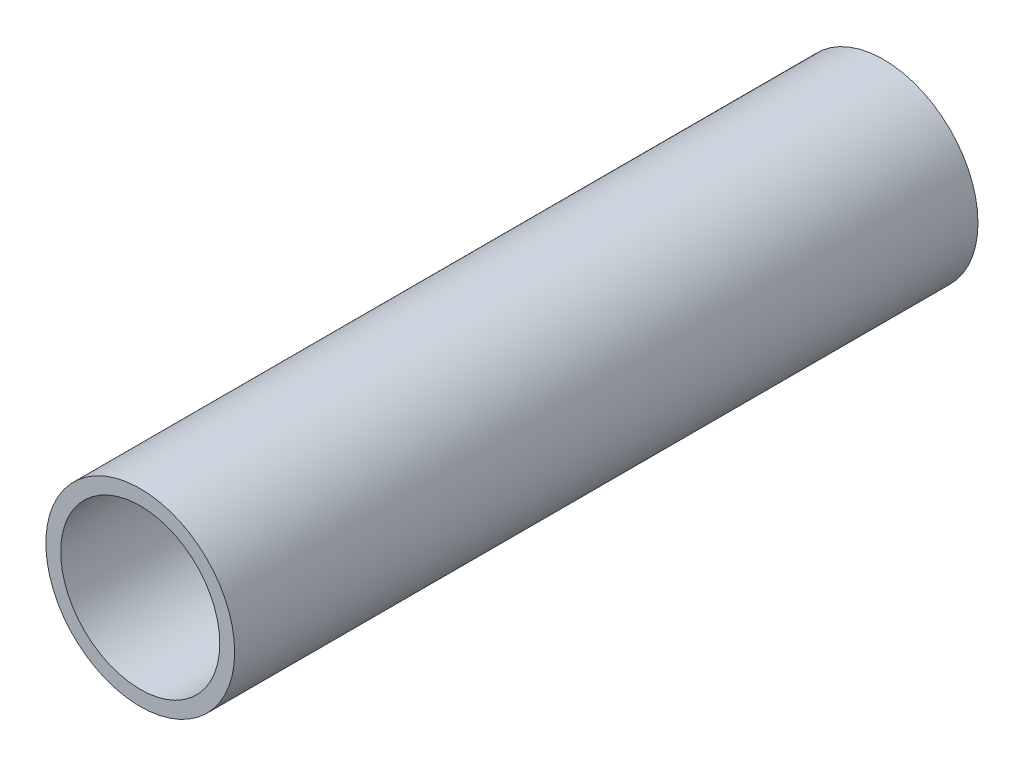
ISO-10303-21;
HEADER;
FILE_DESCRIPTION(('STEP AP214'),'2;1');
FILE_NAME('part.step','',(''),(''),'','','');
FILE_SCHEMA(('AUTOMOTIVE_DESIGN { 1 0 10303 214 1 1 1 1 }'));
ENDSEC;
DATA;
#1=APPLICATION_CONTEXT('core data for automotive mechanical design processes');
#2=APPLICATION_PROTOCOL_DEFINITION('international standard','automotive_design',2000,#1);
#3=PRODUCT_CONTEXT('',#1,'mechanical');
#4=PRODUCT('Part','Part','',(#3));
#5=PRODUCT_RELATED_PRODUCT_CATEGORY('part','',(#4));
#6=PRODUCT_DEFINITION_FORMATION('','',#4);
#7=PRODUCT_DEFINITION_CONTEXT('part definition',#1,'design');
#8=PRODUCT_DEFINITION('design','',#6,#7);
#9=PRODUCT_DEFINITION_SHAPE('','',#8);
#10=(LENGTH_UNIT() NAMED_UNIT(*) SI_UNIT(.MILLI.,.METRE.));
#11=(NAMED_UNIT(*) PLANE_ANGLE_UNIT() SI_UNIT($,.RADIAN.));
#12=(NAMED_UNIT(*) SI_UNIT($,.STERADIAN.) SOLID_ANGLE_UNIT());
#13=UNCERTAINTY_MEASURE_WITH_UNIT(LENGTH_MEASURE(1.E-05),#10,'distance_accuracy_value','');
#14=(GEOMETRIC_REPRESENTATION_CONTEXT(3) GLOBAL_UNCERTAINTY_ASSIGNED_CONTEXT((#13)) GLOBAL_UNIT_ASSIGNED_CONTEXT((#10,
#11,#12)) REPRESENTATION_CONTEXT('',''));
#15=CARTESIAN_POINT('',(0.,0.,0.));
#16=DIRECTION('',(0.,0.,1.));
#17=DIRECTION('',(1.,0.,0.));
#18=AXIS2_PLACEMENT_3D('',#15,#16,#17);
#19=CARTESIAN_POINT('',(0.,0.,-100.));
#20=DIRECTION('',(0.,0.,-1.));
#21=DIRECTION('',(1.,0.,0.));
#22=AXIS2_PLACEMENT_3D('',#19,#20,#21);
#23=PLANE('',#22);
#24=CARTESIAN_POINT('',(0.,0.,-100.));
#25=DIRECTION('',(0.,0.,1.));
#26=DIRECTION('',(1.,0.,0.));
#27=AXIS2_PLACEMENT_3D('',#24,#25,#26);
#28=CIRCLE('',#27,12.7);
#29=CARTESIAN_POINT('',(12.7,0.,-100.));
#30=VERTEX_POINT('',#29);
#31=EDGE_CURVE('E10',#30,#30,#28,.T.);
#32=ORIENTED_EDGE('',*,*,#31,.F.);
#33=EDGE_LOOP('',(#32));
#34=FACE_BOUND('',#33,.T.);
#35=CARTESIAN_POINT('',(0.,0.,-100.));
#36=DIRECTION('',(0.,0.,1.));
#37=DIRECTION('',(1.,0.,0.));
#38=AXIS2_PLACEMENT_3D('',#35,#36,#37);
#39=CIRCLE('',#38,10.7);
#40=CARTESIAN_POINT('',(10.7,0.,-100.));
#41=VERTEX_POINT('',#40);
#42=EDGE_CURVE('E44',#41,#41,#39,.T.);
#43=ORIENTED_EDGE('',*,*,#42,.T.);
#44=EDGE_LOOP('',(#43));
#45=FACE_BOUND('',#44,.T.);
#46=ADVANCED_FACE('F33',(#34,#45),#23,.T.);
#47=CARTESIAN_POINT('',(0.,0.,0.));
#48=DIRECTION('',(0.,0.,-1.));
#49=DIRECTION('',(1.,0.,0.));
#50=AXIS2_PLACEMENT_3D('',#47,#48,#49);
#51=PLANE('',#50);
#52=CARTESIAN_POINT('',(0.,0.,0.));
#53=DIRECTION('',(0.,0.,1.));
#54=DIRECTION('',(1.,0.,0.));
#55=AXIS2_PLACEMENT_3D('',#52,#53,#54);
#56=CIRCLE('',#55,12.7);
#57=CARTESIAN_POINT('',(12.7,0.,0.));
#58=VERTEX_POINT('',#57);
#59=EDGE_CURVE('E37',#58,#58,#56,.T.);
#60=ORIENTED_EDGE('',*,*,#59,.T.);
#61=EDGE_LOOP('',(#60));
#62=FACE_BOUND('',#61,.T.);
#63=CARTESIAN_POINT('',(0.,0.,0.));
#64=DIRECTION('',(0.,0.,1.));
#65=DIRECTION('',(1.,0.,0.));
#66=AXIS2_PLACEMENT_3D('',#63,#64,#65);
#67=CIRCLE('',#66,10.7);
#68=CARTESIAN_POINT('',(10.7,0.,0.));
#69=VERTEX_POINT('',#68);
#70=EDGE_CURVE('E46',#69,#69,#67,.T.);
#71=ORIENTED_EDGE('',*,*,#70,.F.);
#72=EDGE_LOOP('',(#71));
#73=FACE_BOUND('',#72,.T.);
#74=ADVANCED_FACE('F59',(#62,#73),#51,.F.);
#75=CARTESIAN_POINT('',(0.,0.,-100.));
#76=DIRECTION('',(0.,0.,1.));
#77=DIRECTION('',(-1.,0.,0.));
#78=AXIS2_PLACEMENT_3D('',#75,#76,#77);
#79=CYLINDRICAL_SURFACE('',#78,12.7);
#80=ORIENTED_EDGE('',*,*,#31,.T.);
#81=EDGE_LOOP('',(#80));
#82=FACE_BOUND('',#81,.T.);
#83=ORIENTED_EDGE('',*,*,#59,.F.);
#84=EDGE_LOOP('',(#83));
#85=FACE_BOUND('',#84,.T.);
#86=ADVANCED_FACE('F35',(#82,#85),#79,.T.);
#87=CARTESIAN_POINT('',(0.,0.,-100.));
#88=DIRECTION('',(0.,0.,1.));
#89=DIRECTION('',(-1.,0.,0.));
#90=AXIS2_PLACEMENT_3D('',#87,#88,#89);
#91=CYLINDRICAL_SURFACE('',#90,10.7);
#92=ORIENTED_EDGE('',*,*,#42,.F.);
#93=EDGE_LOOP('',(#92));
#94=FACE_BOUND('',#93,.T.);
#95=ORIENTED_EDGE('',*,*,#70,.T.);
#96=EDGE_LOOP('',(#95));
#97=FACE_BOUND('',#96,.T.);
#98=ADVANCED_FACE('F53',(#94,#97),#91,.F.);
#99=CLOSED_SHELL('',(#46,#74,#86,#98));
#100=MANIFOLD_SOLID_BREP('B2',#99);
#101=ADVANCED_BREP_SHAPE_REPRESENTATION('',(#18,#100),#14);
#102=SHAPE_DEFINITION_REPRESENTATION(#9,#101);
ENDSEC;
END-ISO-10303-21;
